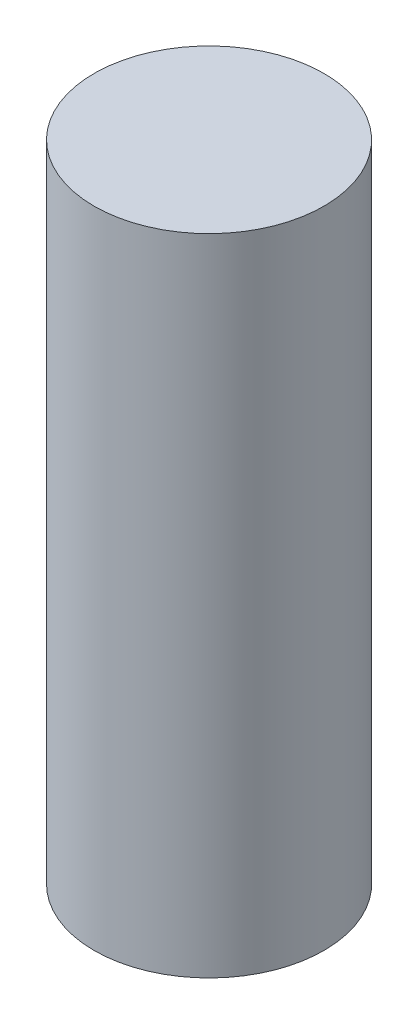
ISO-10303-21;
HEADER;
FILE_DESCRIPTION(('STEP AP214'),'2;1');
FILE_NAME('part.step','',(''),(''),'','','');
FILE_SCHEMA(('AUTOMOTIVE_DESIGN { 1 0 10303 214 1 1 1 1 }'));
ENDSEC;
DATA;
#1=APPLICATION_CONTEXT('core data for automotive mechanical design processes');
#2=APPLICATION_PROTOCOL_DEFINITION('international standard','automotive_design',2000,#1);
#3=PRODUCT_CONTEXT('',#1,'mechanical');
#4=PRODUCT('Part','Part','',(#3));
#5=PRODUCT_RELATED_PRODUCT_CATEGORY('part','',(#4));
#6=PRODUCT_DEFINITION_FORMATION('','',#4);
#7=PRODUCT_DEFINITION_CONTEXT('part definition',#1,'design');
#8=PRODUCT_DEFINITION('design','',#6,#7);
#9=PRODUCT_DEFINITION_SHAPE('','',#8);
#10=(LENGTH_UNIT() NAMED_UNIT(*) SI_UNIT(.MILLI.,.METRE.));
#11=(NAMED_UNIT(*) PLANE_ANGLE_UNIT() SI_UNIT($,.RADIAN.));
#12=(NAMED_UNIT(*) SI_UNIT($,.STERADIAN.) SOLID_ANGLE_UNIT());
#13=UNCERTAINTY_MEASURE_WITH_UNIT(LENGTH_MEASURE(1.E-05),#10,'distance_accuracy_value','');
#14=(GEOMETRIC_REPRESENTATION_CONTEXT(3) GLOBAL_UNCERTAINTY_ASSIGNED_CONTEXT((#13)) GLOBAL_UNIT_ASSIGNED_CONTEXT((#10,
#11,#12)) REPRESENTATION_CONTEXT('',''));
#15=CARTESIAN_POINT('',(0.,0.,0.));
#16=DIRECTION('',(0.,0.,1.));
#17=DIRECTION('',(1.,0.,0.));
#18=AXIS2_PLACEMENT_3D('',#15,#16,#17);
#19=CARTESIAN_POINT('',(0.,15.,0.));
#20=DIRECTION('',(0.,-1.,0.));
#21=DIRECTION('',(0.,0.,-1.));
#22=AXIS2_PLACEMENT_3D('',#19,#20,#21);
#23=CYLINDRICAL_SURFACE('',#22,2.675);
#24=CARTESIAN_POINT('',(0.,15.,0.));
#25=DIRECTION('',(0.,1.,0.));
#26=DIRECTION('',(0.,0.,1.));
#27=AXIS2_PLACEMENT_3D('',#24,#25,#26);
#28=CIRCLE('',#27,2.675);
#29=CARTESIAN_POINT('',(0.,15.,2.675));
#30=VERTEX_POINT('',#29);
#31=EDGE_CURVE('E10',#30,#30,#28,.T.);
#32=ORIENTED_EDGE('',*,*,#31,.F.);
#33=EDGE_LOOP('',(#32));
#34=FACE_BOUND('',#33,.T.);
#35=CARTESIAN_POINT('',(0.,0.,0.));
#36=DIRECTION('',(0.,1.,0.));
#37=DIRECTION('',(0.,0.,1.));
#38=AXIS2_PLACEMENT_3D('',#35,#36,#37);
#39=CIRCLE('',#38,2.675);
#40=CARTESIAN_POINT('',(0.,0.,2.675));
#41=VERTEX_POINT('',#40);
#42=EDGE_CURVE('E34',#41,#41,#39,.T.);
#43=ORIENTED_EDGE('',*,*,#42,.T.);
#44=EDGE_LOOP('',(#43));
#45=FACE_BOUND('',#44,.T.);
#46=ADVANCED_FACE('F31',(#34,#45),#23,.T.);
#47=CARTESIAN_POINT('',(0.,15.,0.));
#48=DIRECTION('',(0.,1.,0.));
#49=DIRECTION('',(0.,0.,1.));
#50=AXIS2_PLACEMENT_3D('',#47,#48,#49);
#51=PLANE('',#50);
#52=ORIENTED_EDGE('',*,*,#31,.T.);
#53=EDGE_LOOP('',(#52));
#54=FACE_BOUND('',#53,.T.);
#55=ADVANCED_FACE('F46',(#54),#51,.T.);
#56=CARTESIAN_POINT('',(0.,0.,0.));
#57=DIRECTION('',(0.,1.,0.));
#58=DIRECTION('',(0.,0.,1.));
#59=AXIS2_PLACEMENT_3D('',#56,#57,#58);
#60=PLANE('',#59);
#61=ORIENTED_EDGE('',*,*,#42,.F.);
#62=EDGE_LOOP('',(#61));
#63=FACE_BOUND('',#62,.T.);
#64=ADVANCED_FACE('F44',(#63),#60,.F.);
#65=CLOSED_SHELL('',(#46,#55,#64));
#66=MANIFOLD_SOLID_BREP('B2',#65);
#67=ADVANCED_BREP_SHAPE_REPRESENTATION('',(#18,#66),#14);
#68=SHAPE_DEFINITION_REPRESENTATION(#9,#67);
ENDSEC;
END-ISO-10303-21;
